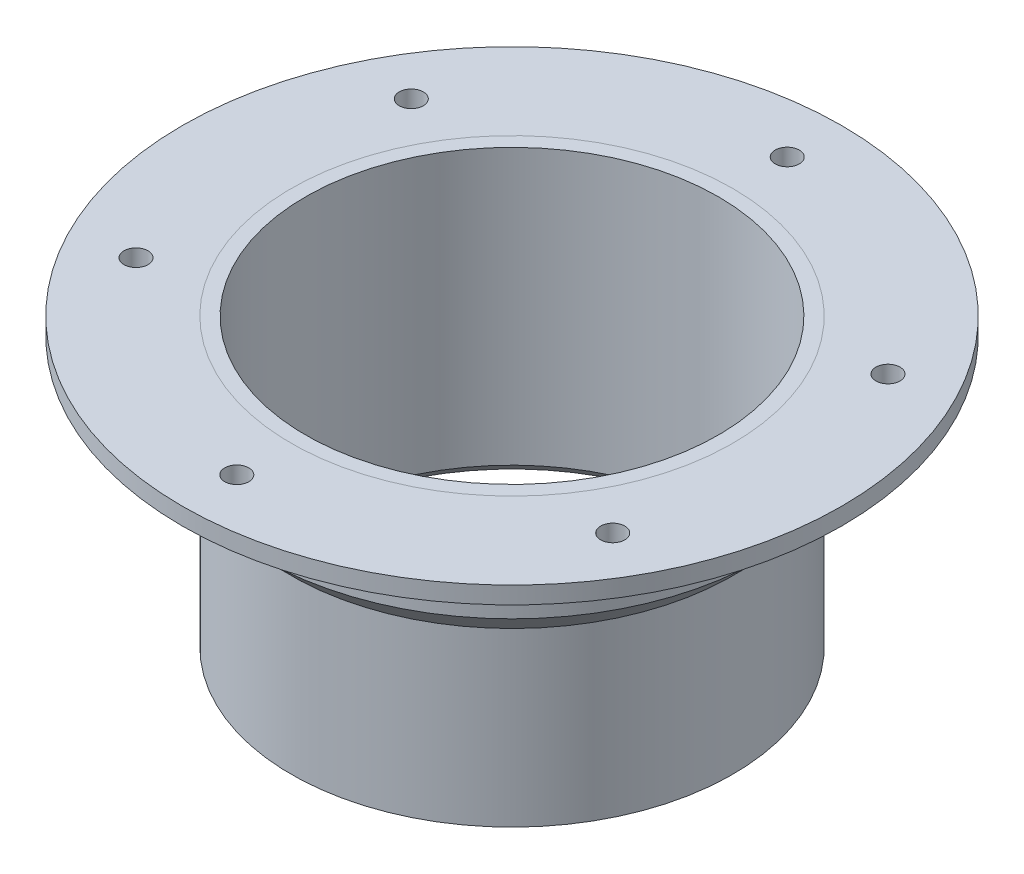
ISO-10303-21;
HEADER;
FILE_DESCRIPTION(('STEP AP214'),'2;1');
FILE_NAME('part.step','',(''),(''),'','','');
FILE_SCHEMA(('AUTOMOTIVE_DESIGN { 1 0 10303 214 1 1 1 1 }'));
ENDSEC;
DATA;
#1=APPLICATION_CONTEXT('core data for automotive mechanical design processes');
#2=APPLICATION_PROTOCOL_DEFINITION('international standard','automotive_design',2000,#1);
#3=PRODUCT_CONTEXT('',#1,'mechanical');
#4=PRODUCT('Part','Part','',(#3));
#5=PRODUCT_RELATED_PRODUCT_CATEGORY('part','',(#4));
#6=PRODUCT_DEFINITION_FORMATION('','',#4);
#7=PRODUCT_DEFINITION_CONTEXT('part definition',#1,'design');
#8=PRODUCT_DEFINITION('design','',#6,#7);
#9=PRODUCT_DEFINITION_SHAPE('','',#8);
#10=(LENGTH_UNIT() NAMED_UNIT(*) SI_UNIT(.MILLI.,.METRE.));
#11=(NAMED_UNIT(*) PLANE_ANGLE_UNIT() SI_UNIT($,.RADIAN.));
#12=(NAMED_UNIT(*) SI_UNIT($,.STERADIAN.) SOLID_ANGLE_UNIT());
#13=UNCERTAINTY_MEASURE_WITH_UNIT(LENGTH_MEASURE(1.E-05),#10,'distance_accuracy_value','');
#14=(GEOMETRIC_REPRESENTATION_CONTEXT(3) GLOBAL_UNCERTAINTY_ASSIGNED_CONTEXT((#13)) GLOBAL_UNIT_ASSIGNED_CONTEXT((#10,
#11,#12)) REPRESENTATION_CONTEXT('',''));
#15=CARTESIAN_POINT('',(0.,0.,0.));
#16=DIRECTION('',(0.,0.,1.));
#17=DIRECTION('',(1.,0.,0.));
#18=AXIS2_PLACEMENT_3D('',#15,#16,#17);
#19=CARTESIAN_POINT('',(0.,0.,0.));
#20=DIRECTION('',(0.,-1.,0.));
#21=DIRECTION('',(0.,0.,-1.));
#22=AXIS2_PLACEMENT_3D('',#19,#20,#21);
#23=CYLINDRICAL_SURFACE('',#22,43.5);
#24=CARTESIAN_POINT('',(0.,-15.,0.));
#25=DIRECTION('',(0.,1.,0.));
#26=DIRECTION('',(1.,0.,0.));
#27=AXIS2_PLACEMENT_3D('',#24,#25,#26);
#28=CIRCLE('',#27,43.5);
#29=CARTESIAN_POINT('',(43.5,-15.,0.));
#30=VERTEX_POINT('',#29);
#31=EDGE_CURVE('P0_E41',#30,#30,#28,.F.);
#32=ORIENTED_EDGE('',*,*,#31,.F.);
#33=EDGE_LOOP('',(#32));
#34=FACE_BOUND('',#33,.T.);
#35=CARTESIAN_POINT('',(0.,-3.,0.));
#36=DIRECTION('',(0.,-1.,0.));
#37=DIRECTION('',(0.,0.,-1.));
#38=AXIS2_PLACEMENT_3D('',#35,#36,#37);
#39=CIRCLE('',#38,43.5);
#40=CARTESIAN_POINT('',(0.,-3.,-43.5));
#41=VERTEX_POINT('',#40);
#42=EDGE_CURVE('P0_E50',#41,#41,#39,.F.);
#43=ORIENTED_EDGE('',*,*,#42,.F.);
#44=EDGE_LOOP('',(#43));
#45=FACE_BOUND('',#44,.T.);
#46=ADVANCED_FACE('P0_F30',(#34,#45),#23,.T.);
#47=CARTESIAN_POINT('',(0.,0.,0.));
#48=DIRECTION('',(0.,1.,0.));
#49=DIRECTION('',(0.,0.,1.));
#50=AXIS2_PLACEMENT_3D('',#47,#48,#49);
#51=PLANE('',#50);
#52=CARTESIAN_POINT('',(41.5692193816528,0.,24.0000000000005));
#53=DIRECTION('',(0.,1.,0.));
#54=DIRECTION('',(0.,0.,1.));
#55=AXIS2_PLACEMENT_3D('',#52,#53,#54);
#56=CIRCLE('',#55,2.1);
#57=CARTESIAN_POINT('',(41.5692193816528,0.,26.1000000000005));
#58=VERTEX_POINT('',#57);
#59=EDGE_CURVE('P0_E86',#58,#58,#56,.T.);
#60=ORIENTED_EDGE('',*,*,#59,.F.);
#61=EDGE_LOOP('',(#60));
#62=FACE_BOUND('',#61,.T.);
#63=CARTESIAN_POINT('',(41.5692193816533,0.,-23.9999999999996));
#64=DIRECTION('',(0.,1.,0.));
#65=DIRECTION('',(0.,0.,1.));
#66=AXIS2_PLACEMENT_3D('',#63,#64,#65);
#67=CIRCLE('',#66,2.1);
#68=CARTESIAN_POINT('',(41.5692193816533,0.,-21.8999999999996));
#69=VERTEX_POINT('',#68);
#70=EDGE_CURVE('P0_E80',#69,#69,#67,.T.);
#71=ORIENTED_EDGE('',*,*,#70,.F.);
#72=EDGE_LOOP('',(#71));
#73=FACE_BOUND('',#72,.T.);
#74=CARTESIAN_POINT('',(0.,0.,-48.));
#75=DIRECTION('',(0.,1.,0.));
#76=DIRECTION('',(0.,0.,1.));
#77=AXIS2_PLACEMENT_3D('',#74,#75,#76);
#78=CIRCLE('',#77,2.1);
#79=CARTESIAN_POINT('',(0.,0.,-45.9));
#80=VERTEX_POINT('',#79);
#81=EDGE_CURVE('P0_E74',#80,#80,#78,.T.);
#82=ORIENTED_EDGE('',*,*,#81,.F.);
#83=EDGE_LOOP('',(#82));
#84=FACE_BOUND('',#83,.T.);
#85=CARTESIAN_POINT('',(-41.5692193816529,0.,-24.0000000000002));
#86=DIRECTION('',(0.,1.,0.));
#87=DIRECTION('',(0.,0.,1.));
#88=AXIS2_PLACEMENT_3D('',#85,#86,#87);
#89=CIRCLE('',#88,2.1);
#90=CARTESIAN_POINT('',(-41.5692193816529,0.,-21.9000000000002));
#91=VERTEX_POINT('',#90);
#92=EDGE_CURVE('P0_E68',#91,#91,#89,.T.);
#93=ORIENTED_EDGE('',*,*,#92,.F.);
#94=EDGE_LOOP('',(#93));
#95=FACE_BOUND('',#94,.T.);
#96=CARTESIAN_POINT('',(-41.5692193816531,0.,23.9999999999999));
#97=DIRECTION('',(0.,1.,0.));
#98=DIRECTION('',(0.,0.,1.));
#99=AXIS2_PLACEMENT_3D('',#96,#97,#98);
#100=CIRCLE('',#99,2.1);
#101=CARTESIAN_POINT('',(-41.5692193816531,0.,26.0999999999999));
#102=VERTEX_POINT('',#101);
#103=EDGE_CURVE('P0_E62',#102,#102,#100,.T.);
#104=ORIENTED_EDGE('',*,*,#103,.F.);
#105=EDGE_LOOP('',(#104));
#106=FACE_BOUND('',#105,.T.);
#107=CARTESIAN_POINT('',(0.,0.,48.));
#108=DIRECTION('',(0.,1.,0.));
#109=DIRECTION('',(0.,0.,1.));
#110=AXIS2_PLACEMENT_3D('',#107,#108,#109);
#111=CIRCLE('',#110,2.1);
#112=CARTESIAN_POINT('',(0.,0.,50.1));
#113=VERTEX_POINT('',#112);
#114=EDGE_CURVE('P0_E56',#113,#113,#111,.T.);
#115=ORIENTED_EDGE('',*,*,#114,.F.);
#116=EDGE_LOOP('',(#115));
#117=FACE_BOUND('',#116,.T.);
#118=CARTESIAN_POINT('',(0.,0.,0.));
#119=DIRECTION('',(0.,-1.,0.));
#120=DIRECTION('',(0.,0.,-1.));
#121=AXIS2_PLACEMENT_3D('',#118,#119,#120);
#122=CIRCLE('',#121,38.5);
#123=CARTESIAN_POINT('',(0.,0.,-38.5));
#124=VERTEX_POINT('',#123);
#125=EDGE_CURVE('P0_E33',#124,#124,#122,.T.);
#126=ORIENTED_EDGE('',*,*,#125,.T.);
#127=EDGE_LOOP('',(#126));
#128=FACE_BOUND('',#127,.T.);
#129=CARTESIAN_POINT('',(0.,0.,0.));
#130=DIRECTION('',(0.,-1.,0.));
#131=DIRECTION('',(0.,0.,-1.));
#132=AXIS2_PLACEMENT_3D('',#129,#130,#131);
#133=CIRCLE('',#132,57.5);
#134=CARTESIAN_POINT('',(0.,0.,-57.5));
#135=VERTEX_POINT('',#134);
#136=EDGE_CURVE('P0_E46',#135,#135,#133,.F.);
#137=ORIENTED_EDGE('',*,*,#136,.T.);
#138=EDGE_LOOP('',(#137));
#139=FACE_BOUND('',#138,.T.);
#140=ADVANCED_FACE('P0_F120',(#62,#73,#84,#95,#106,#117,#128,#139),#51,.T.);
#141=CARTESIAN_POINT('',(0.,-15.,0.));
#142=DIRECTION('',(0.,1.,0.));
#143=DIRECTION('',(0.,0.,1.));
#144=AXIS2_PLACEMENT_3D('',#141,#142,#143);
#145=CONICAL_SURFACE('',#144,43.5,0.785398163397448);
#146=ORIENTED_EDGE('',*,*,#31,.T.);
#147=EDGE_LOOP('',(#146));
#148=FACE_BOUND('',#147,.T.);
#149=CARTESIAN_POINT('',(0.,-20.,0.));
#150=DIRECTION('',(0.,-1.,0.));
#151=DIRECTION('',(0.,0.,-1.));
#152=AXIS2_PLACEMENT_3D('',#149,#150,#151);
#153=CIRCLE('',#152,38.5);
#154=CARTESIAN_POINT('',(0.,-20.,-38.5));
#155=VERTEX_POINT('',#154);
#156=EDGE_CURVE('P0_E10',#155,#155,#153,.F.);
#157=ORIENTED_EDGE('',*,*,#156,.T.);
#158=EDGE_LOOP('',(#157));
#159=FACE_BOUND('',#158,.T.);
#160=ADVANCED_FACE('P0_F128',(#148,#159),#145,.T.);
#161=CARTESIAN_POINT('',(0.,0.,0.));
#162=DIRECTION('',(0.,-1.,0.));
#163=DIRECTION('',(0.,0.,-1.));
#164=AXIS2_PLACEMENT_3D('',#161,#162,#163);
#165=CYLINDRICAL_SURFACE('',#164,38.5);
#166=ORIENTED_EDGE('',*,*,#125,.F.);
#167=EDGE_LOOP('',(#166));
#168=FACE_BOUND('',#167,.T.);
#169=ORIENTED_EDGE('',*,*,#156,.F.);
#170=EDGE_LOOP('',(#169));
#171=FACE_BOUND('',#170,.T.);
#172=ADVANCED_FACE('P0_F99',(#168,#171),#165,.F.);
#173=CARTESIAN_POINT('',(0.,-3.,0.));
#174=DIRECTION('',(0.,1.,0.));
#175=DIRECTION('',(0.,0.,1.));
#176=AXIS2_PLACEMENT_3D('',#173,#174,#175);
#177=PLANE('',#176);
#178=CARTESIAN_POINT('',(41.5692193816528,-3.,24.0000000000005));
#179=DIRECTION('',(0.,-1.,0.));
#180=DIRECTION('',(-0.866025403784433,0.,-0.50000000000001));
#181=AXIS2_PLACEMENT_3D('',#178,#179,#180);
#182=CIRCLE('',#181,2.1);
#183=CARTESIAN_POINT('',(39.7505660337055,-3.,22.9500000000005));
#184=VERTEX_POINT('',#183);
#185=EDGE_CURVE('P0_E89',#184,#184,#182,.T.);
#186=ORIENTED_EDGE('',*,*,#185,.F.);
#187=EDGE_LOOP('',(#186));
#188=FACE_BOUND('',#187,.T.);
#189=CARTESIAN_POINT('',(41.5692193816533,-3.,-23.9999999999996));
#190=DIRECTION('',(0.,-1.,0.));
#191=DIRECTION('',(-0.866025403784443,0.,0.499999999999992));
#192=AXIS2_PLACEMENT_3D('',#189,#190,#191);
#193=CIRCLE('',#192,2.1);
#194=CARTESIAN_POINT('',(39.750566033706,-3.,-22.9499999999996));
#195=VERTEX_POINT('',#194);
#196=EDGE_CURVE('P0_E83',#195,#195,#193,.T.);
#197=ORIENTED_EDGE('',*,*,#196,.F.);
#198=EDGE_LOOP('',(#197));
#199=FACE_BOUND('',#198,.T.);
#200=CARTESIAN_POINT('',(0.,-3.,-48.));
#201=DIRECTION('',(0.,-1.,0.));
#202=DIRECTION('',(0.,0.,1.));
#203=AXIS2_PLACEMENT_3D('',#200,#201,#202);
#204=CIRCLE('',#203,2.1);
#205=CARTESIAN_POINT('',(0.,-3.,-45.9));
#206=VERTEX_POINT('',#205);
#207=EDGE_CURVE('P0_E77',#206,#206,#204,.T.);
#208=ORIENTED_EDGE('',*,*,#207,.F.);
#209=EDGE_LOOP('',(#208));
#210=FACE_BOUND('',#209,.T.);
#211=CARTESIAN_POINT('',(-41.5692193816529,-3.,-24.0000000000002));
#212=DIRECTION('',(0.,-1.,0.));
#213=DIRECTION('',(0.866025403784436,0.,0.500000000000004));
#214=AXIS2_PLACEMENT_3D('',#211,#212,#213);
#215=CIRCLE('',#214,2.1);
#216=CARTESIAN_POINT('',(-39.7505660337056,-3.,-22.9500000000002));
#217=VERTEX_POINT('',#216);
#218=EDGE_CURVE('P0_E71',#217,#217,#215,.T.);
#219=ORIENTED_EDGE('',*,*,#218,.F.);
#220=EDGE_LOOP('',(#219));
#221=FACE_BOUND('',#220,.T.);
#222=CARTESIAN_POINT('',(-41.5692193816531,-3.,23.9999999999999));
#223=DIRECTION('',(0.,-1.,0.));
#224=DIRECTION('',(0.86602540378444,0.,-0.499999999999998));
#225=AXIS2_PLACEMENT_3D('',#222,#223,#224);
#226=CIRCLE('',#225,2.1);
#227=CARTESIAN_POINT('',(-39.7505660337058,-3.,22.9499999999999));
#228=VERTEX_POINT('',#227);
#229=EDGE_CURVE('P0_E65',#228,#228,#226,.T.);
#230=ORIENTED_EDGE('',*,*,#229,.F.);
#231=EDGE_LOOP('',(#230));
#232=FACE_BOUND('',#231,.T.);
#233=CARTESIAN_POINT('',(0.,-3.,48.));
#234=DIRECTION('',(0.,-1.,0.));
#235=DIRECTION('',(0.,0.,-1.));
#236=AXIS2_PLACEMENT_3D('',#233,#234,#235);
#237=CIRCLE('',#236,2.1);
#238=CARTESIAN_POINT('',(0.,-3.,45.9));
#239=VERTEX_POINT('',#238);
#240=EDGE_CURVE('P0_E59',#239,#239,#237,.T.);
#241=ORIENTED_EDGE('',*,*,#240,.F.);
#242=EDGE_LOOP('',(#241));
#243=FACE_BOUND('',#242,.T.);
#244=ORIENTED_EDGE('',*,*,#42,.T.);
#245=EDGE_LOOP('',(#244));
#246=FACE_BOUND('',#245,.T.);
#247=CARTESIAN_POINT('',(0.,-3.,0.));
#248=DIRECTION('',(0.,-1.,0.));
#249=DIRECTION('',(0.,0.,-1.));
#250=AXIS2_PLACEMENT_3D('',#247,#248,#249);
#251=CIRCLE('',#250,57.5);
#252=CARTESIAN_POINT('',(0.,-3.,-57.5));
#253=VERTEX_POINT('',#252);
#254=EDGE_CURVE('P0_E43',#253,#253,#251,.F.);
#255=ORIENTED_EDGE('',*,*,#254,.F.);
#256=EDGE_LOOP('',(#255));
#257=FACE_BOUND('',#256,.T.);
#258=ADVANCED_FACE('P0_F95',(#188,#199,#210,#221,#232,#243,#246,#257),#177,.F.);
#259=CARTESIAN_POINT('',(0.,0.,0.));
#260=DIRECTION('',(0.,-1.,0.));
#261=DIRECTION('',(0.,0.,-1.));
#262=AXIS2_PLACEMENT_3D('',#259,#260,#261);
#263=CYLINDRICAL_SURFACE('',#262,57.5);
#264=ORIENTED_EDGE('',*,*,#136,.F.);
#265=EDGE_LOOP('',(#264));
#266=FACE_BOUND('',#265,.T.);
#267=ORIENTED_EDGE('',*,*,#254,.T.);
#268=EDGE_LOOP('',(#267));
#269=FACE_BOUND('',#268,.T.);
#270=ADVANCED_FACE('P0_F98',(#266,#269),#263,.T.);
#271=CARTESIAN_POINT('',(0.,7.,48.));
#272=DIRECTION('',(0.,-1.,0.));
#273=DIRECTION('',(0.,0.,-1.));
#274=AXIS2_PLACEMENT_3D('',#271,#272,#273);
#275=CYLINDRICAL_SURFACE('',#274,2.1);
#276=ORIENTED_EDGE('',*,*,#114,.T.);
#277=EDGE_LOOP('',(#276));
#278=FACE_BOUND('',#277,.T.);
#279=ORIENTED_EDGE('',*,*,#240,.T.);
#280=EDGE_LOOP('',(#279));
#281=FACE_BOUND('',#280,.T.);
#282=ADVANCED_FACE('P0_F101',(#278,#281),#275,.F.);
#283=CARTESIAN_POINT('',(-41.5692193816531,7.,23.9999999999999));
#284=DIRECTION('',(0.,-1.,0.));
#285=DIRECTION('',(0.,0.,-1.));
#286=AXIS2_PLACEMENT_3D('',#283,#284,#285);
#287=CYLINDRICAL_SURFACE('',#286,2.1);
#288=ORIENTED_EDGE('',*,*,#103,.T.);
#289=EDGE_LOOP('',(#288));
#290=FACE_BOUND('',#289,.T.);
#291=ORIENTED_EDGE('',*,*,#229,.T.);
#292=EDGE_LOOP('',(#291));
#293=FACE_BOUND('',#292,.T.);
#294=ADVANCED_FACE('P0_F124',(#290,#293),#287,.F.);
#295=CARTESIAN_POINT('',(-41.5692193816529,7.,-24.0000000000002));
#296=DIRECTION('',(0.,-1.,0.));
#297=DIRECTION('',(0.,0.,-1.));
#298=AXIS2_PLACEMENT_3D('',#295,#296,#297);
#299=CYLINDRICAL_SURFACE('',#298,2.1);
#300=ORIENTED_EDGE('',*,*,#92,.T.);
#301=EDGE_LOOP('',(#300));
#302=FACE_BOUND('',#301,.T.);
#303=ORIENTED_EDGE('',*,*,#218,.T.);
#304=EDGE_LOOP('',(#303));
#305=FACE_BOUND('',#304,.T.);
#306=ADVANCED_FACE('P0_F174',(#302,#305),#299,.F.);
#307=CARTESIAN_POINT('',(0.,7.,-48.));
#308=DIRECTION('',(0.,-1.,0.));
#309=DIRECTION('',(0.,0.,-1.));
#310=AXIS2_PLACEMENT_3D('',#307,#308,#309);
#311=CYLINDRICAL_SURFACE('',#310,2.1);
#312=ORIENTED_EDGE('',*,*,#81,.T.);
#313=EDGE_LOOP('',(#312));
#314=FACE_BOUND('',#313,.T.);
#315=ORIENTED_EDGE('',*,*,#207,.T.);
#316=EDGE_LOOP('',(#315));
#317=FACE_BOUND('',#316,.T.);
#318=ADVANCED_FACE('P0_F184',(#314,#317),#311,.F.);
#319=CARTESIAN_POINT('',(41.5692193816533,7.,-23.9999999999996));
#320=DIRECTION('',(0.,-1.,0.));
#321=DIRECTION('',(0.,0.,-1.));
#322=AXIS2_PLACEMENT_3D('',#319,#320,#321);
#323=CYLINDRICAL_SURFACE('',#322,2.1);
#324=ORIENTED_EDGE('',*,*,#70,.T.);
#325=EDGE_LOOP('',(#324));
#326=FACE_BOUND('',#325,.T.);
#327=ORIENTED_EDGE('',*,*,#196,.T.);
#328=EDGE_LOOP('',(#327));
#329=FACE_BOUND('',#328,.T.);
#330=ADVANCED_FACE('P0_F194',(#326,#329),#323,.F.);
#331=CARTESIAN_POINT('',(41.5692193816528,7.,24.0000000000005));
#332=DIRECTION('',(0.,-1.,0.));
#333=DIRECTION('',(0.,0.,-1.));
#334=AXIS2_PLACEMENT_3D('',#331,#332,#333);
#335=CYLINDRICAL_SURFACE('',#334,2.1);
#336=ORIENTED_EDGE('',*,*,#59,.T.);
#337=EDGE_LOOP('',(#336));
#338=FACE_BOUND('',#337,.T.);
#339=ORIENTED_EDGE('',*,*,#185,.T.);
#340=EDGE_LOOP('',(#339));
#341=FACE_BOUND('',#340,.T.);
#342=ADVANCED_FACE('P0_F93',(#338,#341),#335,.F.);
#343=CLOSED_SHELL('',(#46,#140,#160,#172,#258,#270,#282,#294,#306,#318,#330,#342));
#344=MANIFOLD_SOLID_BREP('P0_B2',#343);
#345=CARTESIAN_POINT('',(0.,-50.,0.));
#346=DIRECTION('',(0.,-1.,0.));
#347=DIRECTION('',(0.,0.,-1.));
#348=AXIS2_PLACEMENT_3D('',#345,#346,#347);
#349=CONICAL_SURFACE('',#348,38.,0.785398163397448);
#350=CARTESIAN_POINT('',(0.,-48.,0.));
#351=DIRECTION('',(0.,-1.,0.));
#352=DIRECTION('',(0.,0.,-1.));
#353=AXIS2_PLACEMENT_3D('',#350,#351,#352);
#354=CIRCLE('',#353,36.);
#355=CARTESIAN_POINT('',(0.,-48.,-36.));
#356=VERTEX_POINT('',#355);
#357=EDGE_CURVE('P1_E30',#356,#356,#354,.F.);
#358=ORIENTED_EDGE('',*,*,#357,.T.);
#359=EDGE_LOOP('',(#358));
#360=FACE_BOUND('',#359,.T.);
#361=CARTESIAN_POINT('',(0.,-50.,0.));
#362=DIRECTION('',(0.,-1.,0.));
#363=DIRECTION('',(0.,0.,-1.));
#364=AXIS2_PLACEMENT_3D('',#361,#362,#363);
#365=CIRCLE('',#364,38.);
#366=CARTESIAN_POINT('',(0.,-50.,-38.));
#367=VERTEX_POINT('',#366);
#368=EDGE_CURVE('P1_E18',#367,#367,#365,.T.);
#369=ORIENTED_EDGE('',*,*,#368,.T.);
#370=EDGE_LOOP('',(#369));
#371=FACE_BOUND('',#370,.T.);
#372=ADVANCED_FACE('P1_F15',(#360,#371),#349,.F.);
#373=CARTESIAN_POINT('',(0.,0.,0.));
#374=DIRECTION('',(0.,-1.,0.));
#375=DIRECTION('',(0.,0.,-1.));
#376=AXIS2_PLACEMENT_3D('',#373,#374,#375);
#377=CYLINDRICAL_SURFACE('',#376,36.);
#378=CARTESIAN_POINT('',(0.,0.,0.));
#379=DIRECTION('',(0.,-1.,0.));
#380=DIRECTION('',(0.,0.,-1.));
#381=AXIS2_PLACEMENT_3D('',#378,#379,#380);
#382=CIRCLE('',#381,36.);
#383=CARTESIAN_POINT('',(0.,0.,-36.));
#384=VERTEX_POINT('',#383);
#385=EDGE_CURVE('P1_E27',#384,#384,#382,.T.);
#386=ORIENTED_EDGE('',*,*,#385,.F.);
#387=EDGE_LOOP('',(#386));
#388=FACE_BOUND('',#387,.T.);
#389=ORIENTED_EDGE('',*,*,#357,.F.);
#390=EDGE_LOOP('',(#389));
#391=FACE_BOUND('',#390,.T.);
#392=ADVANCED_FACE('P1_F41',(#388,#391),#377,.F.);
#393=CARTESIAN_POINT('',(0.,-50.,0.));
#394=DIRECTION('',(0.,1.,0.));
#395=DIRECTION('',(0.,0.,1.));
#396=AXIS2_PLACEMENT_3D('',#393,#394,#395);
#397=PLANE('',#396);
#398=ORIENTED_EDGE('',*,*,#368,.F.);
#399=EDGE_LOOP('',(#398));
#400=FACE_BOUND('',#399,.T.);
#401=CARTESIAN_POINT('',(0.,-50.,0.));
#402=DIRECTION('',(0.,-1.,0.));
#403=DIRECTION('',(0.,0.,-1.));
#404=AXIS2_PLACEMENT_3D('',#401,#402,#403);
#405=CIRCLE('',#404,38.5);
#406=CARTESIAN_POINT('',(0.,-50.,-38.5));
#407=VERTEX_POINT('',#406);
#408=EDGE_CURVE('P1_E22',#407,#407,#405,.F.);
#409=ORIENTED_EDGE('',*,*,#408,.F.);
#410=EDGE_LOOP('',(#409));
#411=FACE_BOUND('',#410,.T.);
#412=ADVANCED_FACE('P1_F43',(#400,#411),#397,.F.);
#413=CARTESIAN_POINT('',(0.,0.,0.));
#414=DIRECTION('',(0.,1.,0.));
#415=DIRECTION('',(0.,0.,1.));
#416=AXIS2_PLACEMENT_3D('',#413,#414,#415);
#417=PLANE('',#416);
#418=ORIENTED_EDGE('',*,*,#385,.T.);
#419=EDGE_LOOP('',(#418));
#420=FACE_BOUND('',#419,.T.);
#421=CARTESIAN_POINT('',(0.,0.,0.));
#422=DIRECTION('',(0.,-1.,0.));
#423=DIRECTION('',(0.,0.,-1.));
#424=AXIS2_PLACEMENT_3D('',#421,#422,#423);
#425=CIRCLE('',#424,38.5);
#426=CARTESIAN_POINT('',(0.,0.,-38.5));
#427=VERTEX_POINT('',#426);
#428=EDGE_CURVE('P1_E10',#427,#427,#425,.T.);
#429=ORIENTED_EDGE('',*,*,#428,.F.);
#430=EDGE_LOOP('',(#429));
#431=FACE_BOUND('',#430,.T.);
#432=ADVANCED_FACE('P1_F50',(#420,#431),#417,.T.);
#433=CARTESIAN_POINT('',(0.,0.,0.));
#434=DIRECTION('',(0.,-1.,0.));
#435=DIRECTION('',(0.,0.,-1.));
#436=AXIS2_PLACEMENT_3D('',#433,#434,#435);
#437=CYLINDRICAL_SURFACE('',#436,38.5);
#438=ORIENTED_EDGE('',*,*,#428,.T.);
#439=EDGE_LOOP('',(#438));
#440=FACE_BOUND('',#439,.T.);
#441=ORIENTED_EDGE('',*,*,#408,.T.);
#442=EDGE_LOOP('',(#441));
#443=FACE_BOUND('',#442,.T.);
#444=ADVANCED_FACE('P1_F53',(#440,#443),#437,.T.);
#445=CLOSED_SHELL('',(#372,#392,#412,#432,#444));
#446=MANIFOLD_SOLID_BREP('P1_B1',#445);
#447=ADVANCED_BREP_SHAPE_REPRESENTATION('',(#18,#344,#446),#14);
#448=SHAPE_DEFINITION_REPRESENTATION(#9,#447);
ENDSEC;
END-ISO-10303-21;
